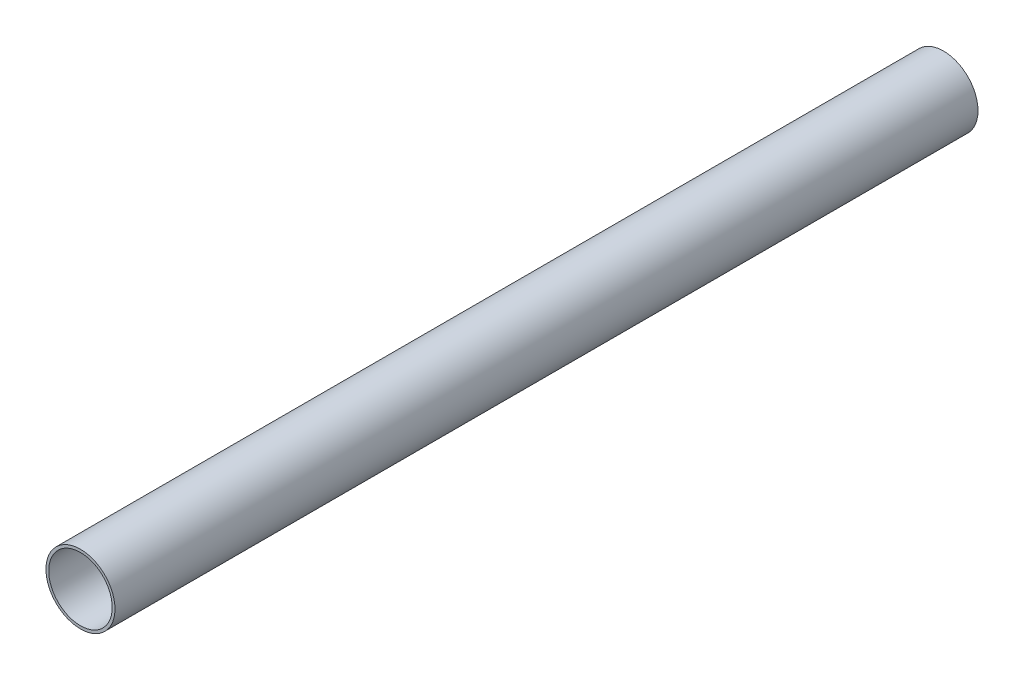
ISO-10303-21;
HEADER;
FILE_DESCRIPTION(('STEP AP214'),'2;1');
FILE_NAME('part.step','',(''),(''),'','','');
FILE_SCHEMA(('AUTOMOTIVE_DESIGN { 1 0 10303 214 1 1 1 1 }'));
ENDSEC;
DATA;
#1=APPLICATION_CONTEXT('core data for automotive mechanical design processes');
#2=APPLICATION_PROTOCOL_DEFINITION('international standard','automotive_design',2000,#1);
#3=PRODUCT_CONTEXT('',#1,'mechanical');
#4=PRODUCT('Part','Part','',(#3));
#5=PRODUCT_RELATED_PRODUCT_CATEGORY('part','',(#4));
#6=PRODUCT_DEFINITION_FORMATION('','',#4);
#7=PRODUCT_DEFINITION_CONTEXT('part definition',#1,'design');
#8=PRODUCT_DEFINITION('design','',#6,#7);
#9=PRODUCT_DEFINITION_SHAPE('','',#8);
#10=(LENGTH_UNIT() NAMED_UNIT(*) SI_UNIT(.MILLI.,.METRE.));
#11=(NAMED_UNIT(*) PLANE_ANGLE_UNIT() SI_UNIT($,.RADIAN.));
#12=(NAMED_UNIT(*) SI_UNIT($,.STERADIAN.) SOLID_ANGLE_UNIT());
#13=UNCERTAINTY_MEASURE_WITH_UNIT(LENGTH_MEASURE(1.E-05),#10,'distance_accuracy_value','');
#14=(GEOMETRIC_REPRESENTATION_CONTEXT(3) GLOBAL_UNCERTAINTY_ASSIGNED_CONTEXT((#13)) GLOBAL_UNIT_ASSIGNED_CONTEXT((#10,
#11,#12)) REPRESENTATION_CONTEXT('',''));
#15=CARTESIAN_POINT('',(0.,0.,0.));
#16=DIRECTION('',(0.,0.,1.));
#17=DIRECTION('',(1.,0.,0.));
#18=AXIS2_PLACEMENT_3D('',#15,#16,#17);
#19=CARTESIAN_POINT('',(0.,0.,500.));
#20=DIRECTION('',(0.,0.,1.));
#21=DIRECTION('',(1.,0.,0.));
#22=AXIS2_PLACEMENT_3D('',#19,#20,#21);
#23=PLANE('',#22);
#24=CARTESIAN_POINT('',(0.,0.,500.));
#25=DIRECTION('',(0.,0.,1.));
#26=DIRECTION('',(1.,0.,0.));
#27=AXIS2_PLACEMENT_3D('',#24,#25,#26);
#28=CIRCLE('',#27,20.);
#29=CARTESIAN_POINT('',(20.,0.,500.));
#30=VERTEX_POINT('',#29);
#31=EDGE_CURVE('E11',#30,#30,#28,.T.);
#32=ORIENTED_EDGE('',*,*,#31,.T.);
#33=EDGE_LOOP('',(#32));
#34=FACE_BOUND('',#33,.T.);
#35=CARTESIAN_POINT('',(0.,0.,500.));
#36=DIRECTION('',(0.,0.,1.));
#37=DIRECTION('',(1.,0.,0.));
#38=AXIS2_PLACEMENT_3D('',#35,#36,#37);
#39=CIRCLE('',#38,18.4);
#40=CARTESIAN_POINT('',(18.4,0.,500.));
#41=VERTEX_POINT('',#40);
#42=EDGE_CURVE('E58',#41,#41,#39,.T.);
#43=ORIENTED_EDGE('',*,*,#42,.F.);
#44=EDGE_LOOP('',(#43));
#45=FACE_BOUND('',#44,.T.);
#46=ADVANCED_FACE('F45',(#34,#45),#23,.T.);
#47=CARTESIAN_POINT('',(0.,0.,0.));
#48=DIRECTION('',(0.,0.,1.));
#49=DIRECTION('',(1.,0.,0.));
#50=AXIS2_PLACEMENT_3D('',#47,#48,#49);
#51=PLANE('',#50);
#52=CARTESIAN_POINT('',(0.,0.,0.));
#53=DIRECTION('',(0.,0.,1.));
#54=DIRECTION('',(1.,0.,0.));
#55=AXIS2_PLACEMENT_3D('',#52,#53,#54);
#56=CIRCLE('',#55,20.);
#57=CARTESIAN_POINT('',(20.,0.,0.));
#58=VERTEX_POINT('',#57);
#59=EDGE_CURVE('E49',#58,#58,#56,.T.);
#60=ORIENTED_EDGE('',*,*,#59,.F.);
#61=EDGE_LOOP('',(#60));
#62=FACE_BOUND('',#61,.T.);
#63=CARTESIAN_POINT('',(0.,0.,0.));
#64=DIRECTION('',(0.,0.,1.));
#65=DIRECTION('',(1.,0.,0.));
#66=AXIS2_PLACEMENT_3D('',#63,#64,#65);
#67=CIRCLE('',#66,18.4);
#68=CARTESIAN_POINT('',(18.4,0.,0.));
#69=VERTEX_POINT('',#68);
#70=EDGE_CURVE('E60',#69,#69,#67,.T.);
#71=ORIENTED_EDGE('',*,*,#70,.T.);
#72=EDGE_LOOP('',(#71));
#73=FACE_BOUND('',#72,.T.);
#74=ADVANCED_FACE('F72',(#62,#73),#51,.F.);
#75=CARTESIAN_POINT('',(0.,0.,500.));
#76=DIRECTION('',(0.,0.,-1.));
#77=DIRECTION('',(-1.,0.,0.));
#78=AXIS2_PLACEMENT_3D('',#75,#76,#77);
#79=CYLINDRICAL_SURFACE('',#78,20.);
#80=ORIENTED_EDGE('',*,*,#31,.F.);
#81=EDGE_LOOP('',(#80));
#82=FACE_BOUND('',#81,.T.);
#83=ORIENTED_EDGE('',*,*,#59,.T.);
#84=EDGE_LOOP('',(#83));
#85=FACE_BOUND('',#84,.T.);
#86=ADVANCED_FACE('F47',(#82,#85),#79,.T.);
#87=CARTESIAN_POINT('',(0.,0.,500.));
#88=DIRECTION('',(0.,0.,-1.));
#89=DIRECTION('',(-1.,0.,0.));
#90=AXIS2_PLACEMENT_3D('',#87,#88,#89);
#91=CYLINDRICAL_SURFACE('',#90,18.4);
#92=ORIENTED_EDGE('',*,*,#42,.T.);
#93=EDGE_LOOP('',(#92));
#94=FACE_BOUND('',#93,.T.);
#95=ORIENTED_EDGE('',*,*,#70,.F.);
#96=EDGE_LOOP('',(#95));
#97=FACE_BOUND('',#96,.T.);
#98=ADVANCED_FACE('F68',(#94,#97),#91,.F.);
#99=CLOSED_SHELL('',(#46,#74,#86,#98));
#100=MANIFOLD_SOLID_BREP('B2',#99);
#101=ADVANCED_BREP_SHAPE_REPRESENTATION('',(#18,#100),#14);
#102=SHAPE_DEFINITION_REPRESENTATION(#9,#101);
ENDSEC;
END-ISO-10303-21;
